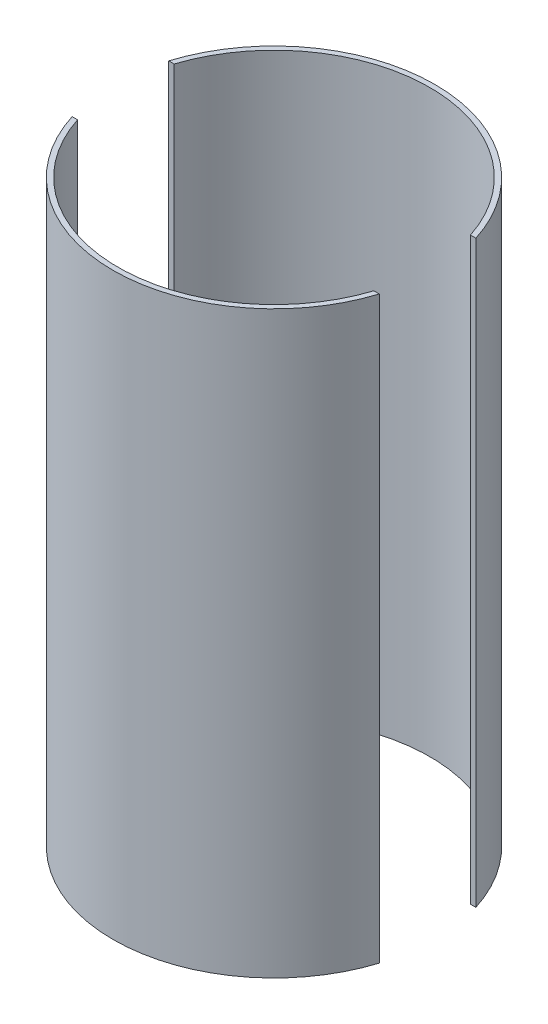
ISO-10303-21;
HEADER;
FILE_DESCRIPTION(('STEP AP214'),'2;1');
FILE_NAME('part.step','',(''),(''),'','','');
FILE_SCHEMA(('AUTOMOTIVE_DESIGN { 1 0 10303 214 1 1 1 1 }'));
ENDSEC;
DATA;
#1=APPLICATION_CONTEXT('core data for automotive mechanical design processes');
#2=APPLICATION_PROTOCOL_DEFINITION('international standard','automotive_design',2000,#1);
#3=PRODUCT_CONTEXT('',#1,'mechanical');
#4=PRODUCT('Part','Part','',(#3));
#5=PRODUCT_RELATED_PRODUCT_CATEGORY('part','',(#4));
#6=PRODUCT_DEFINITION_FORMATION('','',#4);
#7=PRODUCT_DEFINITION_CONTEXT('part definition',#1,'design');
#8=PRODUCT_DEFINITION('design','',#6,#7);
#9=PRODUCT_DEFINITION_SHAPE('','',#8);
#10=(LENGTH_UNIT() NAMED_UNIT(*) SI_UNIT(.MILLI.,.METRE.));
#11=(NAMED_UNIT(*) PLANE_ANGLE_UNIT() SI_UNIT($,.RADIAN.));
#12=(NAMED_UNIT(*) SI_UNIT($,.STERADIAN.) SOLID_ANGLE_UNIT());
#13=UNCERTAINTY_MEASURE_WITH_UNIT(LENGTH_MEASURE(1.E-05),#10,'distance_accuracy_value','');
#14=(GEOMETRIC_REPRESENTATION_CONTEXT(3) GLOBAL_UNCERTAINTY_ASSIGNED_CONTEXT((#13)) GLOBAL_UNIT_ASSIGNED_CONTEXT((#10,
#11,#12)) REPRESENTATION_CONTEXT('',''));
#15=CARTESIAN_POINT('',(0.,0.,0.));
#16=DIRECTION('',(0.,0.,1.));
#17=DIRECTION('',(1.,0.,0.));
#18=AXIS2_PLACEMENT_3D('',#15,#16,#17);
#19=CARTESIAN_POINT('',(0.,114.3,0.));
#20=DIRECTION('',(0.,1.,0.));
#21=DIRECTION('',(0.,0.,1.));
#22=AXIS2_PLACEMENT_3D('',#19,#20,#21);
#23=PLANE('',#22);
#24=DIRECTION('',(1.,0.,0.));
#25=VECTOR('',#24,1.);
#26=CARTESIAN_POINT('',(0.,114.3,19.05));
#27=LINE('',#26,#25);
#28=CARTESIAN_POINT('',(-60.5751392899761,114.3,19.05));
#29=VERTEX_POINT('',#28);
#30=CARTESIAN_POINT('',(-58.4415308149949,114.3,19.05));
#31=VERTEX_POINT('',#30);
#32=EDGE_CURVE('E61',#29,#31,#27,.T.);
#33=ORIENTED_EDGE('',*,*,#32,.F.);
#34=CARTESIAN_POINT('',(0.,114.3,0.));
#35=DIRECTION('',(0.,1.,0.));
#36=DIRECTION('',(0.,0.,1.));
#37=AXIS2_PLACEMENT_3D('',#34,#35,#36);
#38=CIRCLE('',#37,63.5);
#39=CARTESIAN_POINT('',(60.5751392899761,114.3,19.05));
#40=VERTEX_POINT('',#39);
#41=EDGE_CURVE('E120',#29,#40,#38,.T.);
#42=ORIENTED_EDGE('',*,*,#41,.T.);
#43=CARTESIAN_POINT('',(58.4415308149949,114.3,19.05));
#44=VERTEX_POINT('',#43);
#45=EDGE_CURVE('E98',#44,#40,#27,.T.);
#46=ORIENTED_EDGE('',*,*,#45,.F.);
#47=CARTESIAN_POINT('',(0.,114.3,0.));
#48=DIRECTION('',(0.,1.,0.));
#49=DIRECTION('',(0.,0.,1.));
#50=AXIS2_PLACEMENT_3D('',#47,#48,#49);
#51=CIRCLE('',#50,61.468);
#52=EDGE_CURVE('E104',#31,#44,#51,.T.);
#53=ORIENTED_EDGE('',*,*,#52,.F.);
#54=EDGE_LOOP('',(#33,#42,#46,#53));
#55=FACE_BOUND('',#54,.T.);
#56=ADVANCED_FACE('F52',(#55),#23,.T.);
#57=CARTESIAN_POINT('',(0.,-114.3,0.));
#58=DIRECTION('',(0.,1.,0.));
#59=DIRECTION('',(0.,0.,1.));
#60=AXIS2_PLACEMENT_3D('',#57,#58,#59);
#61=PLANE('',#60);
#62=CARTESIAN_POINT('',(0.,-114.3,0.));
#63=DIRECTION('',(0.,1.,0.));
#64=DIRECTION('',(0.,0.,1.));
#65=AXIS2_PLACEMENT_3D('',#62,#63,#64);
#66=CIRCLE('',#65,63.5);
#67=CARTESIAN_POINT('',(-60.5751392899761,-114.3,19.05));
#68=VERTEX_POINT('',#67);
#69=CARTESIAN_POINT('',(60.5751392899761,-114.3,19.05));
#70=VERTEX_POINT('',#69);
#71=EDGE_CURVE('E105',#68,#70,#66,.T.);
#72=ORIENTED_EDGE('',*,*,#71,.F.);
#73=DIRECTION('',(1.,0.,0.));
#74=VECTOR('',#73,1.);
#75=CARTESIAN_POINT('',(0.,-114.3,19.05));
#76=LINE('',#75,#74);
#77=CARTESIAN_POINT('',(-58.4415308149949,-114.3,19.05));
#78=VERTEX_POINT('',#77);
#79=EDGE_CURVE('E74',#68,#78,#76,.T.);
#80=ORIENTED_EDGE('',*,*,#79,.T.);
#81=CARTESIAN_POINT('',(0.,-114.3,0.));
#82=DIRECTION('',(0.,1.,0.));
#83=DIRECTION('',(0.,0.,1.));
#84=AXIS2_PLACEMENT_3D('',#81,#82,#83);
#85=CIRCLE('',#84,61.468);
#86=CARTESIAN_POINT('',(58.4415308149949,-114.3,19.05));
#87=VERTEX_POINT('',#86);
#88=EDGE_CURVE('E55',#78,#87,#85,.T.);
#89=ORIENTED_EDGE('',*,*,#88,.T.);
#90=EDGE_CURVE('E93',#87,#70,#76,.T.);
#91=ORIENTED_EDGE('',*,*,#90,.T.);
#92=EDGE_LOOP('',(#72,#80,#89,#91));
#93=FACE_BOUND('',#92,.T.);
#94=ADVANCED_FACE('F110',(#93),#61,.F.);
#95=CARTESIAN_POINT('',(0.,114.3,0.));
#96=DIRECTION('',(0.,-1.,0.));
#97=DIRECTION('',(0.,0.,-1.));
#98=AXIS2_PLACEMENT_3D('',#95,#96,#97);
#99=CYLINDRICAL_SURFACE('',#98,63.5);
#100=ORIENTED_EDGE('',*,*,#41,.F.);
#101=DIRECTION('',(0.,-1.,0.));
#102=VECTOR('',#101,1.);
#103=CARTESIAN_POINT('',(-60.5751392899761,114.3,19.05));
#104=LINE('',#103,#102);
#105=EDGE_CURVE('E69',#29,#68,#104,.T.);
#106=ORIENTED_EDGE('',*,*,#105,.T.);
#107=ORIENTED_EDGE('',*,*,#71,.T.);
#108=DIRECTION('',(0.,-1.,0.));
#109=VECTOR('',#108,1.);
#110=CARTESIAN_POINT('',(60.5751392899761,114.3,19.05));
#111=LINE('',#110,#109);
#112=EDGE_CURVE('E96',#70,#40,#111,.F.);
#113=ORIENTED_EDGE('',*,*,#112,.T.);
#114=EDGE_LOOP('',(#100,#106,#107,#113));
#115=FACE_BOUND('',#114,.T.);
#116=ADVANCED_FACE('F114',(#115),#99,.T.);
#117=CARTESIAN_POINT('',(0.,114.3,0.));
#118=DIRECTION('',(0.,-1.,0.));
#119=DIRECTION('',(0.,0.,-1.));
#120=AXIS2_PLACEMENT_3D('',#117,#118,#119);
#121=CYLINDRICAL_SURFACE('',#120,61.468);
#122=DIRECTION('',(0.,-1.,0.));
#123=VECTOR('',#122,1.);
#124=CARTESIAN_POINT('',(-58.4415308149949,114.3,19.05));
#125=LINE('',#124,#123);
#126=EDGE_CURVE('E12',#31,#78,#125,.T.);
#127=ORIENTED_EDGE('',*,*,#126,.F.);
#128=ORIENTED_EDGE('',*,*,#52,.T.);
#129=DIRECTION('',(0.,-1.,0.));
#130=VECTOR('',#129,1.);
#131=CARTESIAN_POINT('',(58.4415308149949,114.3,19.05));
#132=LINE('',#131,#130);
#133=EDGE_CURVE('E88',#87,#44,#132,.F.);
#134=ORIENTED_EDGE('',*,*,#133,.F.);
#135=ORIENTED_EDGE('',*,*,#88,.F.);
#136=EDGE_LOOP('',(#127,#128,#134,#135));
#137=FACE_BOUND('',#136,.T.);
#138=ADVANCED_FACE('F133',(#137),#121,.F.);
#139=CARTESIAN_POINT('',(0.,-114.3,19.05));
#140=DIRECTION('',(0.,0.,1.));
#141=DIRECTION('',(1.,0.,0.));
#142=AXIS2_PLACEMENT_3D('',#139,#140,#141);
#143=PLANE('',#142);
#144=ORIENTED_EDGE('',*,*,#90,.F.);
#145=ORIENTED_EDGE('',*,*,#133,.T.);
#146=ORIENTED_EDGE('',*,*,#45,.T.);
#147=ORIENTED_EDGE('',*,*,#112,.F.);
#148=EDGE_LOOP('',(#144,#145,#146,#147));
#149=FACE_BOUND('',#148,.T.);
#150=ADVANCED_FACE('F97',(#149),#143,.F.);
#151=ORIENTED_EDGE('',*,*,#32,.T.);
#152=ORIENTED_EDGE('',*,*,#126,.T.);
#153=ORIENTED_EDGE('',*,*,#79,.F.);
#154=ORIENTED_EDGE('',*,*,#105,.F.);
#155=EDGE_LOOP('',(#151,#152,#153,#154));
#156=FACE_BOUND('',#155,.T.);
#157=ADVANCED_FACE('F131',(#156),#143,.F.);
#158=CLOSED_SHELL('',(#56,#94,#116,#138,#150,#157));
#159=MANIFOLD_SOLID_BREP('B2',#158);
#160=CARTESIAN_POINT('',(0.,114.3,0.));
#161=DIRECTION('',(0.,-1.,0.));
#162=DIRECTION('',(0.,0.,-1.));
#163=AXIS2_PLACEMENT_3D('',#160,#161,#162);
#164=CYLINDRICAL_SURFACE('',#163,61.468);
#165=CARTESIAN_POINT('',(0.,114.3,0.));
#166=DIRECTION('',(0.,1.,0.));
#167=DIRECTION('',(0.,0.,1.));
#168=AXIS2_PLACEMENT_3D('',#165,#166,#167);
#169=CIRCLE('',#168,61.468);
#170=CARTESIAN_POINT('',(58.4415308149949,114.3,-19.05));
#171=VERTEX_POINT('',#170);
#172=CARTESIAN_POINT('',(-58.4415308149949,114.3,-19.05));
#173=VERTEX_POINT('',#172);
#174=EDGE_CURVE('E256',#171,#173,#169,.T.);
#175=ORIENTED_EDGE('',*,*,#174,.T.);
#176=DIRECTION('',(0.,-1.,0.));
#177=VECTOR('',#176,1.);
#178=CARTESIAN_POINT('',(-58.4415308149949,114.3,-19.05));
#179=LINE('',#178,#177);
#180=CARTESIAN_POINT('',(-58.4415308149949,-114.3,-19.05));
#181=VERTEX_POINT('',#180);
#182=EDGE_CURVE('E50',#173,#181,#179,.T.);
#183=ORIENTED_EDGE('',*,*,#182,.T.);
#184=CARTESIAN_POINT('',(0.,-114.3,0.));
#185=DIRECTION('',(0.,1.,0.));
#186=DIRECTION('',(0.,0.,1.));
#187=AXIS2_PLACEMENT_3D('',#184,#185,#186);
#188=CIRCLE('',#187,61.468);
#189=CARTESIAN_POINT('',(58.4415308149949,-114.3,-19.05));
#190=VERTEX_POINT('',#189);
#191=EDGE_CURVE('E251',#190,#181,#188,.T.);
#192=ORIENTED_EDGE('',*,*,#191,.F.);
#193=DIRECTION('',(0.,-1.,0.));
#194=VECTOR('',#193,1.);
#195=CARTESIAN_POINT('',(58.4415308149949,114.3,-19.05));
#196=LINE('',#195,#194);
#197=EDGE_CURVE('E204',#190,#171,#196,.F.);
#198=ORIENTED_EDGE('',*,*,#197,.T.);
#199=EDGE_LOOP('',(#175,#183,#192,#198));
#200=FACE_BOUND('',#199,.T.);
#201=ADVANCED_FACE('F196',(#200),#164,.F.);
#202=CARTESIAN_POINT('',(0.,114.3,0.));
#203=DIRECTION('',(0.,-1.,0.));
#204=DIRECTION('',(0.,0.,-1.));
#205=AXIS2_PLACEMENT_3D('',#202,#203,#204);
#206=CYLINDRICAL_SURFACE('',#205,63.5);
#207=DIRECTION('',(0.,-1.,0.));
#208=VECTOR('',#207,1.);
#209=CARTESIAN_POINT('',(-60.5751392899761,114.3,-19.05));
#210=LINE('',#209,#208);
#211=CARTESIAN_POINT('',(-60.5751392899761,114.3,-19.05));
#212=VERTEX_POINT('',#211);
#213=CARTESIAN_POINT('',(-60.5751392899761,-114.3,-19.05));
#214=VERTEX_POINT('',#213);
#215=EDGE_CURVE('E237',#212,#214,#210,.T.);
#216=ORIENTED_EDGE('',*,*,#215,.F.);
#217=CARTESIAN_POINT('',(0.,114.3,0.));
#218=DIRECTION('',(0.,1.,0.));
#219=DIRECTION('',(0.,0.,1.));
#220=AXIS2_PLACEMENT_3D('',#217,#218,#219);
#221=CIRCLE('',#220,63.5);
#222=CARTESIAN_POINT('',(60.5751392899761,114.3,-19.05));
#223=VERTEX_POINT('',#222);
#224=EDGE_CURVE('E248',#223,#212,#221,.T.);
#225=ORIENTED_EDGE('',*,*,#224,.F.);
#226=DIRECTION('',(0.,-1.,0.));
#227=VECTOR('',#226,1.);
#228=CARTESIAN_POINT('',(60.5751392899761,114.3,-19.05));
#229=LINE('',#228,#227);
#230=CARTESIAN_POINT('',(60.5751392899761,-114.3,-19.05));
#231=VERTEX_POINT('',#230);
#232=EDGE_CURVE('E252',#231,#223,#229,.F.);
#233=ORIENTED_EDGE('',*,*,#232,.F.);
#234=CARTESIAN_POINT('',(0.,-114.3,0.));
#235=DIRECTION('',(0.,1.,0.));
#236=DIRECTION('',(0.,0.,1.));
#237=AXIS2_PLACEMENT_3D('',#234,#235,#236);
#238=CIRCLE('',#237,63.5);
#239=EDGE_CURVE('E250',#231,#214,#238,.T.);
#240=ORIENTED_EDGE('',*,*,#239,.T.);
#241=EDGE_LOOP('',(#216,#225,#233,#240));
#242=FACE_BOUND('',#241,.T.);
#243=ADVANCED_FACE('F198',(#242),#206,.T.);
#244=CARTESIAN_POINT('',(0.,-114.3,0.));
#245=DIRECTION('',(0.,1.,0.));
#246=DIRECTION('',(0.,0.,1.));
#247=AXIS2_PLACEMENT_3D('',#244,#245,#246);
#248=PLANE('',#247);
#249=DIRECTION('',(1.,0.,0.));
#250=VECTOR('',#249,1.);
#251=CARTESIAN_POINT('',(0.,-114.3,-19.05));
#252=LINE('',#251,#250);
#253=EDGE_CURVE('E211',#214,#181,#252,.T.);
#254=ORIENTED_EDGE('',*,*,#253,.F.);
#255=ORIENTED_EDGE('',*,*,#239,.F.);
#256=EDGE_CURVE('E242',#190,#231,#252,.T.);
#257=ORIENTED_EDGE('',*,*,#256,.F.);
#258=ORIENTED_EDGE('',*,*,#191,.T.);
#259=EDGE_LOOP('',(#254,#255,#257,#258));
#260=FACE_BOUND('',#259,.T.);
#261=ADVANCED_FACE('F267',(#260),#248,.F.);
#262=CARTESIAN_POINT('',(0.,114.3,0.));
#263=DIRECTION('',(0.,1.,0.));
#264=DIRECTION('',(0.,0.,1.));
#265=AXIS2_PLACEMENT_3D('',#262,#263,#264);
#266=PLANE('',#265);
#267=ORIENTED_EDGE('',*,*,#224,.T.);
#268=DIRECTION('',(1.,0.,0.));
#269=VECTOR('',#268,1.);
#270=CARTESIAN_POINT('',(0.,114.3,-19.05));
#271=LINE('',#270,#269);
#272=EDGE_CURVE('E234',#212,#173,#271,.T.);
#273=ORIENTED_EDGE('',*,*,#272,.T.);
#274=ORIENTED_EDGE('',*,*,#174,.F.);
#275=EDGE_CURVE('E218',#171,#223,#271,.T.);
#276=ORIENTED_EDGE('',*,*,#275,.T.);
#277=EDGE_LOOP('',(#267,#273,#274,#276));
#278=FACE_BOUND('',#277,.T.);
#279=ADVANCED_FACE('F254',(#278),#266,.T.);
#280=CARTESIAN_POINT('',(0.,-114.3,-19.05));
#281=DIRECTION('',(0.,0.,1.));
#282=DIRECTION('',(1.,0.,0.));
#283=AXIS2_PLACEMENT_3D('',#280,#281,#282);
#284=PLANE('',#283);
#285=ORIENTED_EDGE('',*,*,#232,.T.);
#286=ORIENTED_EDGE('',*,*,#275,.F.);
#287=ORIENTED_EDGE('',*,*,#197,.F.);
#288=ORIENTED_EDGE('',*,*,#256,.T.);
#289=EDGE_LOOP('',(#285,#286,#287,#288));
#290=FACE_BOUND('',#289,.T.);
#291=ADVANCED_FACE('F264',(#290),#284,.T.);
#292=ORIENTED_EDGE('',*,*,#215,.T.);
#293=ORIENTED_EDGE('',*,*,#253,.T.);
#294=ORIENTED_EDGE('',*,*,#182,.F.);
#295=ORIENTED_EDGE('',*,*,#272,.F.);
#296=EDGE_LOOP('',(#292,#293,#294,#295));
#297=FACE_BOUND('',#296,.T.);
#298=ADVANCED_FACE('F236',(#297),#284,.T.);
#299=CLOSED_SHELL('',(#201,#243,#261,#279,#291,#298));
#300=MANIFOLD_SOLID_BREP('B6',#299);
#301=ADVANCED_BREP_SHAPE_REPRESENTATION('',(#18,#159,#300),#14);
#302=SHAPE_DEFINITION_REPRESENTATION(#9,#301);
ENDSEC;
END-ISO-10303-21;
